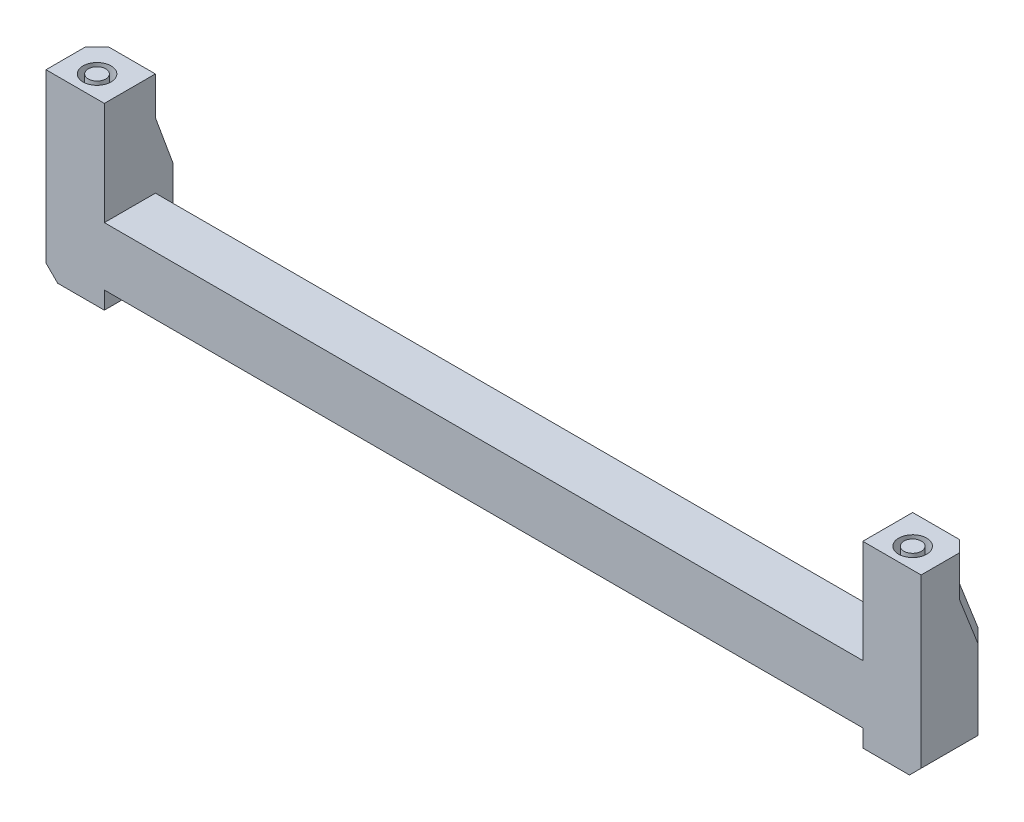
ISO-10303-21;
HEADER;
FILE_DESCRIPTION(('STEP AP214'),'2;1');
FILE_NAME('part.step','',(''),(''),'','','');
FILE_SCHEMA(('AUTOMOTIVE_DESIGN { 1 0 10303 214 1 1 1 1 }'));
ENDSEC;
DATA;
#1=APPLICATION_CONTEXT('core data for automotive mechanical design processes');
#2=APPLICATION_PROTOCOL_DEFINITION('international standard','automotive_design',2000,#1);
#3=PRODUCT_CONTEXT('',#1,'mechanical');
#4=PRODUCT('Part','Part','',(#3));
#5=PRODUCT_RELATED_PRODUCT_CATEGORY('part','',(#4));
#6=PRODUCT_DEFINITION_FORMATION('','',#4);
#7=PRODUCT_DEFINITION_CONTEXT('part definition',#1,'design');
#8=PRODUCT_DEFINITION('design','',#6,#7);
#9=PRODUCT_DEFINITION_SHAPE('','',#8);
#10=(LENGTH_UNIT() NAMED_UNIT(*) SI_UNIT(.MILLI.,.METRE.));
#11=(NAMED_UNIT(*) PLANE_ANGLE_UNIT() SI_UNIT($,.RADIAN.));
#12=(NAMED_UNIT(*) SI_UNIT($,.STERADIAN.) SOLID_ANGLE_UNIT());
#13=UNCERTAINTY_MEASURE_WITH_UNIT(LENGTH_MEASURE(1.E-05),#10,'distance_accuracy_value','');
#14=(GEOMETRIC_REPRESENTATION_CONTEXT(3) GLOBAL_UNCERTAINTY_ASSIGNED_CONTEXT((#13)) GLOBAL_UNIT_ASSIGNED_CONTEXT((#10,
#11,#12)) REPRESENTATION_CONTEXT('',''));
#15=CARTESIAN_POINT('',(0.,0.,0.));
#16=DIRECTION('',(0.,0.,1.));
#17=DIRECTION('',(1.,0.,0.));
#18=AXIS2_PLACEMENT_3D('',#15,#16,#17);
#19=CARTESIAN_POINT('',(0.,-66.,-23.149994967554));
#20=DIRECTION('',(0.,-1.,0.));
#21=DIRECTION('',(0.,0.,-1.));
#22=AXIS2_PLACEMENT_3D('',#19,#20,#21);
#23=PLANE('',#22);
#24=CARTESIAN_POINT('',(-69.9989956396422,-66.,-15.0000008092634));
#25=DIRECTION('',(0.,1.,0.));
#26=DIRECTION('',(0.,0.,1.));
#27=AXIS2_PLACEMENT_3D('',#24,#25,#26);
#28=CIRCLE('',#27,1.5);
#29=CARTESIAN_POINT('',(-69.9989956396422,-66.,-13.5000008092634));
#30=VERTEX_POINT('',#29);
#31=EDGE_CURVE('E20',#30,#30,#28,.F.);
#32=ORIENTED_EDGE('',*,*,#31,.F.);
#33=EDGE_LOOP('',(#32));
#34=FACE_BOUND('',#33,.T.);
#35=ADVANCED_FACE('F17',(#34),#23,.F.);
#36=CARTESIAN_POINT('',(0.,-66.,-23.149994967554));
#37=DIRECTION('',(0.,-1.,0.));
#38=DIRECTION('',(0.,0.,-1.));
#39=AXIS2_PLACEMENT_3D('',#36,#37,#38);
#40=PLANE('',#39);
#41=CARTESIAN_POINT('',(70.0010010799524,-66.,-14.7999967067693));
#42=DIRECTION('',(0.,1.,0.));
#43=DIRECTION('',(0.,0.,1.));
#44=AXIS2_PLACEMENT_3D('',#41,#42,#43);
#45=CIRCLE('',#44,1.5);
#46=CARTESIAN_POINT('',(70.0010010799524,-66.,-13.2999967067693));
#47=VERTEX_POINT('',#46);
#48=EDGE_CURVE('E235',#47,#47,#45,.F.);
#49=ORIENTED_EDGE('',*,*,#48,.F.);
#50=EDGE_LOOP('',(#49));
#51=FACE_BOUND('',#50,.T.);
#52=ADVANCED_FACE('F245',(#51),#40,.F.);
#53=CARTESIAN_POINT('',(-69.9989956396422,-96.6999990873044,-15.0000008092632));
#54=DIRECTION('',(0.,1.,0.));
#55=DIRECTION('',(0.,0.,1.));
#56=AXIS2_PLACEMENT_3D('',#53,#54,#55);
#57=CYLINDRICAL_SURFACE('',#56,1.5);
#58=CARTESIAN_POINT('',(-69.9989956396422,-69.5000000037508,-15.0000008092633));
#59=DIRECTION('',(0.,1.,0.));
#60=DIRECTION('',(0.,0.,1.));
#61=AXIS2_PLACEMENT_3D('',#58,#59,#60);
#62=CIRCLE('',#61,1.5);
#63=CARTESIAN_POINT('',(-69.9989956396422,-69.5000000037508,-13.5000008092633));
#64=VERTEX_POINT('',#63);
#65=EDGE_CURVE('E233',#64,#64,#62,.F.);
#66=ORIENTED_EDGE('',*,*,#65,.F.);
#67=EDGE_LOOP('',(#66));
#68=FACE_BOUND('',#67,.T.);
#69=ORIENTED_EDGE('',*,*,#31,.T.);
#70=EDGE_LOOP('',(#69));
#71=FACE_BOUND('',#70,.T.);
#72=ADVANCED_FACE('F242',(#68,#71),#57,.T.);
#73=CARTESIAN_POINT('',(70.0010010799524,-96.7000010766095,-14.7999967067691));
#74=DIRECTION('',(0.,1.,0.));
#75=DIRECTION('',(0.,0.,1.));
#76=AXIS2_PLACEMENT_3D('',#73,#74,#75);
#77=CYLINDRICAL_SURFACE('',#76,1.5);
#78=CARTESIAN_POINT('',(70.0010010799524,-69.5000000037257,-14.7999967067692));
#79=DIRECTION('',(0.,1.,0.));
#80=DIRECTION('',(0.,0.,1.));
#81=AXIS2_PLACEMENT_3D('',#78,#79,#80);
#82=CIRCLE('',#81,1.5);
#83=CARTESIAN_POINT('',(70.0010010799524,-69.5000000037257,-13.2999967067692));
#84=VERTEX_POINT('',#83);
#85=EDGE_CURVE('E213',#84,#84,#82,.F.);
#86=ORIENTED_EDGE('',*,*,#85,.F.);
#87=EDGE_LOOP('',(#86));
#88=FACE_BOUND('',#87,.T.);
#89=ORIENTED_EDGE('',*,*,#48,.T.);
#90=EDGE_LOOP('',(#89));
#91=FACE_BOUND('',#90,.T.);
#92=ADVANCED_FACE('F376',(#88,#91),#77,.T.);
#93=CARTESIAN_POINT('',(-64.9989954728614,-69.5000000037255,19.7999944223629));
#94=DIRECTION('',(0.,1.,0.));
#95=DIRECTION('',(0.,0.,1.));
#96=AXIS2_PLACEMENT_3D('',#93,#94,#95);
#97=PLANE('',#96);
#98=ORIENTED_EDGE('',*,*,#65,.T.);
#99=EDGE_LOOP('',(#98));
#100=FACE_BOUND('',#99,.T.);
#101=CARTESIAN_POINT('',(-69.9989956396422,-69.5000000037508,-15.0000008092634));
#102=DIRECTION('',(0.,-1.,0.));
#103=DIRECTION('',(0.,0.,-1.));
#104=AXIS2_PLACEMENT_3D('',#101,#102,#103);
#105=CIRCLE('',#104,2.4);
#106=CARTESIAN_POINT('',(-69.9989956396422,-69.5000000037508,-17.4000008092634));
#107=VERTEX_POINT('',#106);
#108=EDGE_CURVE('E193',#107,#107,#105,.F.);
#109=ORIENTED_EDGE('',*,*,#108,.T.);
#110=EDGE_LOOP('',(#109));
#111=FACE_BOUND('',#110,.T.);
#112=ADVANCED_FACE('F372',(#100,#111),#97,.T.);
#113=CARTESIAN_POINT('',(65.0010010559896,-69.5000000037257,-19.7999945127524));
#114=DIRECTION('',(0.,1.,0.));
#115=DIRECTION('',(0.,0.,1.));
#116=AXIS2_PLACEMENT_3D('',#113,#114,#115);
#117=PLANE('',#116);
#118=ORIENTED_EDGE('',*,*,#85,.T.);
#119=EDGE_LOOP('',(#118));
#120=FACE_BOUND('',#119,.T.);
#121=CARTESIAN_POINT('',(70.0010010799524,-69.5000000037509,-14.7999967067693));
#122=DIRECTION('',(0.,-1.,0.));
#123=DIRECTION('',(0.,0.,-1.));
#124=AXIS2_PLACEMENT_3D('',#121,#122,#123);
#125=CIRCLE('',#124,2.4);
#126=CARTESIAN_POINT('',(70.0010010799524,-69.5000000037509,-17.1999967067693));
#127=VERTEX_POINT('',#126);
#128=EDGE_CURVE('E224',#127,#127,#125,.F.);
#129=ORIENTED_EDGE('',*,*,#128,.T.);
#130=EDGE_LOOP('',(#129));
#131=FACE_BOUND('',#130,.T.);
#132=ADVANCED_FACE('F368',(#120,#131),#117,.T.);
#133=CARTESIAN_POINT('',(74.001001045446,-84.7000002719467,-21.9999988959935));
#134=DIRECTION('',(0.707106777797698,0.,-0.707106784575397));
#135=DIRECTION('',(-0.707106784575397,0.,-0.707106777797698));
#136=AXIS2_PLACEMENT_3D('',#133,#134,#135);
#137=PLANE('',#136);
#138=DIRECTION('',(0.577350271956594,-0.577350269189632,0.577350266422652));
#139=VECTOR('',#138,1.);
#140=CARTESIAN_POINT('',(73.0010010406534,-93.7000010766095,-22.9999988912009));
#141=LINE('',#140,#139);
#142=CARTESIAN_POINT('',(73.001001045446,-93.700001081402,-22.9999988864083));
#143=VERTEX_POINT('',#142);
#144=CARTESIAN_POINT('',(74.5010010478422,-95.2000010766095,-21.4999988983897));
#145=VERTEX_POINT('',#144);
#146=EDGE_CURVE('E447',#143,#145,#141,.T.);
#147=ORIENTED_EDGE('',*,*,#146,.F.);
#148=DIRECTION('',(0.,1.,0.));
#149=VECTOR('',#148,1.);
#150=CARTESIAN_POINT('',(73.0010010406534,-80.7000000037258,-22.999998891201));
#151=LINE('',#150,#149);
#152=CARTESIAN_POINT('',(73.0010010425704,-80.7000000037258,-22.999998891201));
#153=VERTEX_POINT('',#152);
#154=EDGE_CURVE('E456',#153,#143,#151,.F.);
#155=ORIENTED_EDGE('',*,*,#154,.F.);
#156=DIRECTION('',(-0.700926771305778,0.131921688709775,-0.700926764587299));
#157=VECTOR('',#156,1.);
#158=CARTESIAN_POINT('',(75.0010010502385,-81.076420750493,-20.9999989007861));
#159=LINE('',#158,#157);
#160=CARTESIAN_POINT('',(75.0010010502385,-81.0764207504929,-20.9999989007861));
#161=VERTEX_POINT('',#160);
#162=EDGE_CURVE('E209',#161,#153,#159,.T.);
#163=ORIENTED_EDGE('',*,*,#162,.F.);
#164=DIRECTION('',(0.,1.,0.));
#165=VECTOR('',#164,1.);
#166=CARTESIAN_POINT('',(75.0010010502385,-80.3500005401675,-20.999998900786));
#167=LINE('',#166,#165);
#168=CARTESIAN_POINT('',(75.0010010502385,-94.7000010766095,-20.999998900786));
#169=VERTEX_POINT('',#168);
#170=EDGE_CURVE('E227',#169,#161,#167,.T.);
#171=ORIENTED_EDGE('',*,*,#170,.F.);
#172=DIRECTION('',(-0.577350271956609,-0.577350269189626,-0.577350266422643));
#173=VECTOR('',#172,1.);
#174=CARTESIAN_POINT('',(75.0010010502385,-94.7000010766095,-20.999998900786));
#175=LINE('',#174,#173);
#176=EDGE_CURVE('E211',#169,#145,#175,.T.);
#177=ORIENTED_EDGE('',*,*,#176,.T.);
#178=EDGE_LOOP('',(#147,#155,#163,#171,#177));
#179=FACE_BOUND('',#178,.T.);
#180=ADVANCED_FACE('F364',(#179),#137,.T.);
#181=CARTESIAN_POINT('',(74.0010010488274,-79.0802158249389,-21.294439089428));
#182=DIRECTION('',(0.70710677802957,0.257063659426426,-0.658724737251406));
#183=DIRECTION('',(-0.681631317766084,0.,-0.731695801983633));
#184=AXIS2_PLACEMENT_3D('',#181,#182,#183);
#185=PLANE('',#184);
#186=DIRECTION('',(0.,0.931577452499033,0.36354291355411));
#187=VECTOR('',#186,1.);
#188=CARTESIAN_POINT('',(73.0010010559896,-72.499999990741,-19.7999945460257));
#189=LINE('',#188,#187);
#190=CARTESIAN_POINT('',(73.001001055991,-72.4999999972334,-19.7999945485593));
#191=VERTEX_POINT('',#190);
#192=EDGE_CURVE('E458',#191,#153,#189,.F.);
#193=ORIENTED_EDGE('',*,*,#192,.F.);
#194=DIRECTION('',(-0.700926771305773,0.131921688709743,-0.70092676458731));
#195=VECTOR('',#194,1.);
#196=CARTESIAN_POINT('',(75.0010010655747,-72.8764207504928,-17.799994560678));
#197=LINE('',#196,#195);
#198=CARTESIAN_POINT('',(75.0010010875147,-72.8764207546221,-17.799994538738));
#199=VERTEX_POINT('',#198);
#200=EDGE_CURVE('E442',#199,#191,#197,.T.);
#201=ORIENTED_EDGE('',*,*,#200,.F.);
#202=DIRECTION('',(1.74230028606085E-09,0.931577452499034,0.363542913554108));
#203=VECTOR('',#202,1.);
#204=CARTESIAN_POINT('',(75.0010010502385,-81.076420750493,-20.9999989007861));
#205=LINE('',#204,#203);
#206=EDGE_CURVE('E438',#161,#199,#205,.T.);
#207=ORIENTED_EDGE('',*,*,#206,.F.);
#208=ORIENTED_EDGE('',*,*,#162,.T.);
#209=EDGE_LOOP('',(#193,#201,#207,#208));
#210=FACE_BOUND('',#209,.T.);
#211=ADVANCED_FACE('F360',(#210),#185,.T.);
#212=CARTESIAN_POINT('',(-73.9989956689181,-78.4407562479254,-21.1086263529858));
#213=DIRECTION('',(-0.707106784369094,0.242948518321957,-0.664060247977822));
#214=DIRECTION('',(-0.684570540346749,0.,0.728946620329198));
#215=AXIS2_PLACEMENT_3D('',#212,#213,#214);
#216=PLANE('',#215);
#217=DIRECTION('',(-1.64663216250992E-09,-0.939123013715632,-0.343581089569362));
#218=VECTOR('',#217,1.);
#219=CARTESIAN_POINT('',(-74.99899565402,-72.8543675060854,-18.0000053389722));
#220=LINE('',#219,#218);
#221=CARTESIAN_POINT('',(-74.9989956540199,-72.8543675060933,-18.0000053389751));
#222=VERTEX_POINT('',#221);
#223=CARTESIAN_POINT('',(-74.9989956683975,-81.0543675060853,-21.0000009660859));
#224=VERTEX_POINT('',#223);
#225=EDGE_CURVE('E415',#222,#224,#220,.T.);
#226=ORIENTED_EDGE('',*,*,#225,.F.);
#227=DIRECTION('',(-0.701621528632481,-0.124315934947432,0.701621535357608));
#228=VECTOR('',#227,1.);
#229=CARTESIAN_POINT('',(-72.998995663605,-72.5000000037257,-20.0000053485573));
#230=LINE('',#229,#228);
#231=CARTESIAN_POINT('',(-72.9989956671994,-72.5000000037257,-20.0000053485573));
#232=VERTEX_POINT('',#231);
#233=EDGE_CURVE('E206',#232,#222,#230,.T.);
#234=ORIENTED_EDGE('',*,*,#233,.F.);
#235=DIRECTION('',(0.,0.939123013715632,0.343581089569361));
#236=VECTOR('',#235,1.);
#237=CARTESIAN_POINT('',(-72.9989956779826,-80.7000000160967,-23.0000009801971));
#238=LINE('',#237,#236);
#239=CARTESIAN_POINT('',(-72.9989956779826,-80.700000005272,-23.0000009762368));
#240=VERTEX_POINT('',#239);
#241=EDGE_CURVE('E200',#240,#232,#238,.T.);
#242=ORIENTED_EDGE('',*,*,#241,.F.);
#243=DIRECTION('',(0.701621528632486,0.124315934947432,-0.701621535357603));
#244=VECTOR('',#243,1.);
#245=CARTESIAN_POINT('',(-74.9989956683975,-81.0543675060853,-21.0000009660859));
#246=LINE('',#245,#244);
#247=EDGE_CURVE('E176',#224,#240,#246,.T.);
#248=ORIENTED_EDGE('',*,*,#247,.F.);
#249=EDGE_LOOP('',(#226,#234,#242,#248));
#250=FACE_BOUND('',#249,.T.);
#251=ADVANCED_FACE('F357',(#250),#216,.T.);
#252=CARTESIAN_POINT('',(-73.9989956731901,-92.6999993164097,-22.0000009708784));
#253=DIRECTION('',(-0.707106784575395,0.,-0.7071067777977));
#254=DIRECTION('',(-0.7071067777977,0.,0.707106784575395));
#255=AXIS2_PLACEMENT_3D('',#252,#253,#254);
#256=PLANE('',#255);
#257=DIRECTION('',(0.577350266422667,-0.57735026918965,-0.577350271956561));
#258=VECTOR('',#257,1.);
#259=CARTESIAN_POINT('',(-74.9989956683976,-94.6999990873045,-21.0000009660859));
#260=LINE('',#259,#258);
#261=CARTESIAN_POINT('',(-74.9989956625567,-94.6999990931453,-21.0000009719268));
#262=VERTEX_POINT('',#261);
#263=CARTESIAN_POINT('',(-74.4989956707938,-95.1999990873044,-21.5000009684821));
#264=VERTEX_POINT('',#263);
#265=EDGE_CURVE('E421',#262,#264,#260,.T.);
#266=ORIENTED_EDGE('',*,*,#265,.F.);
#267=DIRECTION('',(0.,1.,0.));
#268=VECTOR('',#267,1.);
#269=CARTESIAN_POINT('',(-74.9989956683977,-66.,-21.0000009660859));
#270=LINE('',#269,#268);
#271=EDGE_CURVE('E413',#224,#262,#270,.F.);
#272=ORIENTED_EDGE('',*,*,#271,.F.);
#273=ORIENTED_EDGE('',*,*,#247,.T.);
#274=DIRECTION('',(0.,1.,0.));
#275=VECTOR('',#274,1.);
#276=CARTESIAN_POINT('',(-72.9989956779826,-96.6999990873044,-23.000000975671));
#277=LINE('',#276,#275);
#278=CARTESIAN_POINT('',(-72.9989956779826,-93.6999990873044,-23.000000975671));
#279=VERTEX_POINT('',#278);
#280=EDGE_CURVE('E192',#279,#240,#277,.T.);
#281=ORIENTED_EDGE('',*,*,#280,.F.);
#282=DIRECTION('',(0.577350266422641,0.577350269189624,-0.577350271956612));
#283=VECTOR('',#282,1.);
#284=CARTESIAN_POINT('',(-74.4989956707938,-95.1999990873044,-21.5000009684821));
#285=LINE('',#284,#283);
#286=EDGE_CURVE('E183',#264,#279,#285,.T.);
#287=ORIENTED_EDGE('',*,*,#286,.F.);
#288=EDGE_LOOP('',(#266,#272,#273,#281,#287));
#289=FACE_BOUND('',#288,.T.);
#290=ADVANCED_FACE('F202',(#289),#256,.T.);
#291=CARTESIAN_POINT('',(-73.9989956588124,-80.6000002719466,-19.0000053437648));
#292=DIRECTION('',(-0.707106784575395,0.,-0.7071067777977));
#293=DIRECTION('',(-0.7071067777977,0.,0.707106784575395));
#294=AXIS2_PLACEMENT_3D('',#291,#292,#293);
#295=PLANE('',#294);
#296=ORIENTED_EDGE('',*,*,#233,.T.);
#297=DIRECTION('',(0.,1.,0.));
#298=VECTOR('',#297,1.);
#299=CARTESIAN_POINT('',(-74.99899565402,-66.,-18.0000053389838));
#300=LINE('',#299,#298);
#301=CARTESIAN_POINT('',(-74.9989956459326,-66.0000000001406,-18.0000053470688));
#302=VERTEX_POINT('',#301);
#303=EDGE_CURVE('E405',#302,#222,#300,.F.);
#304=ORIENTED_EDGE('',*,*,#303,.F.);
#305=DIRECTION('',(0.707106777799487,0.,-0.707106784573608));
#306=VECTOR('',#305,1.);
#307=CARTESIAN_POINT('',(-74.9989956540217,-66.,-18.0000053389838));
#308=LINE('',#307,#306);
#309=CARTESIAN_POINT('',(-72.9989956636055,-66.0000000004257,-20.0000053485577));
#310=VERTEX_POINT('',#309);
#311=EDGE_CURVE('E396',#302,#310,#308,.T.);
#312=ORIENTED_EDGE('',*,*,#311,.T.);
#313=DIRECTION('',(0.,1.,0.));
#314=VECTOR('',#313,1.);
#315=CARTESIAN_POINT('',(-72.998995663605,-72.5000000037257,-20.0000053485574));
#316=LINE('',#315,#314);
#317=EDGE_CURVE('E403',#232,#310,#316,.T.);
#318=ORIENTED_EDGE('',*,*,#317,.F.);
#319=EDGE_LOOP('',(#296,#304,#312,#318));
#320=FACE_BOUND('',#319,.T.);
#321=ADVANCED_FACE('F350',(#320),#295,.T.);
#322=CARTESIAN_POINT('',(-69.9989956396422,-68.5000000037256,-15.0000008092634));
#323=DIRECTION('',(0.,-1.,0.));
#324=DIRECTION('',(0.,0.,-1.));
#325=AXIS2_PLACEMENT_3D('',#322,#323,#324);
#326=CYLINDRICAL_SURFACE('',#325,2.4);
#327=ORIENTED_EDGE('',*,*,#108,.F.);
#328=EDGE_LOOP('',(#327));
#329=FACE_BOUND('',#328,.T.);
#330=CARTESIAN_POINT('',(-69.9989956396422,-66.,-15.0000008092634));
#331=DIRECTION('',(0.,-1.,0.));
#332=DIRECTION('',(0.,0.,-1.));
#333=AXIS2_PLACEMENT_3D('',#330,#331,#332);
#334=CIRCLE('',#333,2.4);
#335=CARTESIAN_POINT('',(-69.9989956396422,-66.,-17.4000008092634));
#336=VERTEX_POINT('',#335);
#337=EDGE_CURVE('E219',#336,#336,#334,.F.);
#338=ORIENTED_EDGE('',*,*,#337,.T.);
#339=EDGE_LOOP('',(#338));
#340=FACE_BOUND('',#339,.T.);
#341=ADVANCED_FACE('F347',(#329,#340),#326,.F.);
#342=CARTESIAN_POINT('',(-64.9989956707938,-95.1999990873044,-21.5000010140114));
#343=DIRECTION('',(-3.38884685552269E-09,-0.707106781186551,-0.707106781186544));
#344=DIRECTION('',(0.,0.707106781186544,-0.707106781186551));
#345=AXIS2_PLACEMENT_3D('',#342,#343,#344);
#346=PLANE('',#345);
#347=ORIENTED_EDGE('',*,*,#286,.T.);
#348=DIRECTION('',(-1.,0.,4.79255318387948E-09));
#349=VECTOR('',#348,1.);
#350=CARTESIAN_POINT('',(-64.9989956779826,-93.6999990873044,-23.0000010140114));
#351=LINE('',#350,#349);
#352=CARTESIAN_POINT('',(-64.9989956779826,-93.6999990968895,-23.0000010044263));
#353=VERTEX_POINT('',#352);
#354=EDGE_CURVE('E187',#353,#279,#351,.T.);
#355=ORIENTED_EDGE('',*,*,#354,.F.);
#356=DIRECTION('',(-3.38884831051159E-09,0.707106781186548,-0.707106781186547));
#357=VECTOR('',#356,1.);
#358=CARTESIAN_POINT('',(-64.9989956636049,-96.6999990873044,-20.0000010140114));
#359=LINE('',#358,#357);
#360=CARTESIAN_POINT('',(-64.9989956671994,-96.6999990873088,-20.0000009948368));
#361=VERTEX_POINT('',#360);
#362=EDGE_CURVE('E551',#361,#353,#359,.T.);
#363=ORIENTED_EDGE('',*,*,#362,.F.);
#364=DIRECTION('',(1.,0.,0.));
#365=VECTOR('',#364,1.);
#366=CARTESIAN_POINT('',(-64.9989956013018,-96.6999990873044,-20.000000975671));
#367=LINE('',#366,#365);
#368=CARTESIAN_POINT('',(-72.998995662996,-96.6999990777193,-20.0000009852561));
#369=VERTEX_POINT('',#368);
#370=EDGE_CURVE('E423',#369,#361,#367,.T.);
#371=ORIENTED_EDGE('',*,*,#370,.F.);
#372=DIRECTION('',(0.577350271956621,-0.577350269189627,0.577350266422629));
#373=VECTOR('',#372,1.);
#374=CARTESIAN_POINT('',(-74.4989956707938,-95.1999990873044,-21.5000009684821));
#375=LINE('',#374,#373);
#376=EDGE_CURVE('E190',#264,#369,#375,.T.);
#377=ORIENTED_EDGE('',*,*,#376,.F.);
#378=EDGE_LOOP('',(#347,#355,#363,#371,#377));
#379=FACE_BOUND('',#378,.T.);
#380=ADVANCED_FACE('F185',(#379),#346,.T.);
#381=CARTESIAN_POINT('',(-64.9989956779826,-96.6999990873044,-23.0000010140114));
#382=DIRECTION('',(-4.79255318387948E-09,0.,-1.));
#383=DIRECTION('',(-1.,0.,4.79255318387948E-09));
#384=AXIS2_PLACEMENT_3D('',#381,#382,#383);
#385=PLANE('',#384);
#386=DIRECTION('',(0.,1.,0.));
#387=VECTOR('',#386,1.);
#388=CARTESIAN_POINT('',(-64.9989956779826,-79.6000005401674,-23.0000010140114));
#389=LINE('',#388,#387);
#390=CARTESIAN_POINT('',(-64.9989956743882,-80.7000000037255,-23.0000010140115));
#391=VERTEX_POINT('',#390);
#392=EDGE_CURVE('E199',#353,#391,#389,.T.);
#393=ORIENTED_EDGE('',*,*,#392,.F.);
#394=ORIENTED_EDGE('',*,*,#354,.T.);
#395=ORIENTED_EDGE('',*,*,#280,.T.);
#396=DIRECTION('',(1.,1.54638873356066E-09,-4.22680203284067E-09));
#397=VECTOR('',#396,1.);
#398=CARTESIAN_POINT('',(-64.9989956779826,-80.7000000037256,-23.0000010140115));
#399=LINE('',#398,#397);
#400=EDGE_CURVE('E465',#391,#240,#399,.F.);
#401=ORIENTED_EDGE('',*,*,#400,.F.);
#402=EDGE_LOOP('',(#393,#394,#395,#401));
#403=FACE_BOUND('',#402,.T.);
#404=ADVANCED_FACE('F196',(#403),#385,.T.);
#405=CARTESIAN_POINT('',(-64.9989956779826,-80.7000000037256,-23.0000010140115));
#406=DIRECTION('',(-4.50079698943524E-09,0.343581089569361,-0.939123013715632));
#407=DIRECTION('',(0.,0.939123013715632,0.343581089569361));
#408=AXIS2_PLACEMENT_3D('',#405,#406,#407);
#409=PLANE('',#408);
#410=DIRECTION('',(1.64663057312578E-09,0.939123013715632,0.343581089569362));
#411=VECTOR('',#410,1.);
#412=CARTESIAN_POINT('',(-64.9989956779826,-80.7000000037256,-23.0000010140115));
#413=LINE('',#412,#411);
#414=CARTESIAN_POINT('',(-64.9989956636078,-72.4999999975401,-20.0000053846348));
#415=VERTEX_POINT('',#414);
#416=EDGE_CURVE('E548',#391,#415,#413,.T.);
#417=ORIENTED_EDGE('',*,*,#416,.F.);
#418=ORIENTED_EDGE('',*,*,#400,.T.);
#419=ORIENTED_EDGE('',*,*,#241,.T.);
#420=DIRECTION('',(-1.,0.,4.79255318387948E-09));
#421=VECTOR('',#420,1.);
#422=CARTESIAN_POINT('',(-64.998995663605,-72.5000000037257,-20.0000053868978));
#423=LINE('',#422,#421);
#424=EDGE_CURVE('E462',#415,#232,#423,.T.);
#425=ORIENTED_EDGE('',*,*,#424,.F.);
#426=EDGE_LOOP('',(#417,#418,#419,#425));
#427=FACE_BOUND('',#426,.T.);
#428=ADVANCED_FACE('F338',(#427),#409,.T.);
#429=CARTESIAN_POINT('',(-64.998995663605,-72.5000000037257,-20.0000053868978));
#430=DIRECTION('',(-4.79255318387948E-09,0.,-1.));
#431=DIRECTION('',(-1.,0.,4.79255318387948E-09));
#432=AXIS2_PLACEMENT_3D('',#429,#430,#431);
#433=PLANE('',#432);
#434=ORIENTED_EDGE('',*,*,#424,.T.);
#435=ORIENTED_EDGE('',*,*,#317,.T.);
#436=DIRECTION('',(1.,0.,0.));
#437=VECTOR('',#436,1.);
#438=CARTESIAN_POINT('',(0.,-66.,-20.0000053485588));
#439=LINE('',#438,#437);
#440=CARTESIAN_POINT('',(-64.9989956636134,-66.0000000004298,-20.0000053773131));
#441=VERTEX_POINT('',#440);
#442=EDGE_CURVE('E223',#310,#441,#439,.T.);
#443=ORIENTED_EDGE('',*,*,#442,.T.);
#444=DIRECTION('',(0.,1.,0.));
#445=VECTOR('',#444,1.);
#446=CARTESIAN_POINT('',(-64.998995663605,-79.6000005401674,-20.0000053868978));
#447=LINE('',#446,#445);
#448=EDGE_CURVE('E470',#415,#441,#447,.T.);
#449=ORIENTED_EDGE('',*,*,#448,.F.);
#450=EDGE_LOOP('',(#434,#435,#443,#449));
#451=FACE_BOUND('',#450,.T.);
#452=ADVANCED_FACE('F334',(#451),#433,.T.);
#453=CARTESIAN_POINT('',(65.0010010559896,-72.5000000037257,-19.7999945127524));
#454=DIRECTION('',(-4.46463881615503E-09,0.36354291355411,-0.931577452499033));
#455=DIRECTION('',(0.,0.931577452499033,0.36354291355411));
#456=AXIS2_PLACEMENT_3D('',#453,#454,#455);
#457=PLANE('',#456);
#458=DIRECTION('',(-1.74230028606086E-09,-0.931577452499033,-0.363542913554112));
#459=VECTOR('',#458,1.);
#460=CARTESIAN_POINT('',(65.0010010559896,-72.5000000037257,-19.7999945127524));
#461=LINE('',#460,#459);
#462=CARTESIAN_POINT('',(65.0010010521555,-72.5000000037372,-19.7999945127569));
#463=VERTEX_POINT('',#462);
#464=CARTESIAN_POINT('',(65.0010010406534,-80.7000000102181,-22.9999988553941));
#465=VERTEX_POINT('',#464);
#466=EDGE_CURVE('E533',#463,#465,#461,.T.);
#467=ORIENTED_EDGE('',*,*,#466,.F.);
#468=DIRECTION('',(-1.,0.,4.79255783207104E-09));
#469=VECTOR('',#468,1.);
#470=CARTESIAN_POINT('',(75.0010010559896,-72.5000000037257,-19.799994560678));
#471=LINE('',#470,#469);
#472=EDGE_CURVE('E445',#191,#463,#471,.T.);
#473=ORIENTED_EDGE('',*,*,#472,.F.);
#474=ORIENTED_EDGE('',*,*,#192,.T.);
#475=DIRECTION('',(-1.,0.,4.79255783207104E-09));
#476=VECTOR('',#475,1.);
#477=CARTESIAN_POINT('',(65.0010010406534,-80.7000000037258,-22.9999988528605));
#478=LINE('',#477,#476);
#479=EDGE_CURVE('E453',#465,#153,#478,.F.);
#480=ORIENTED_EDGE('',*,*,#479,.F.);
#481=EDGE_LOOP('',(#467,#473,#474,#480));
#482=FACE_BOUND('',#481,.T.);
#483=ADVANCED_FACE('F330',(#482),#457,.T.);
#484=CARTESIAN_POINT('',(65.0010010406534,-80.7000000037258,-22.9999988528605));
#485=DIRECTION('',(-4.79255783207104E-09,0.,-1.));
#486=DIRECTION('',(-1.,0.,4.79255783207104E-09));
#487=AXIS2_PLACEMENT_3D('',#484,#485,#486);
#488=PLANE('',#487);
#489=DIRECTION('',(0.,1.,0.));
#490=VECTOR('',#489,1.);
#491=CARTESIAN_POINT('',(65.0010010406534,-79.6000005401675,-22.9999988528605));
#492=LINE('',#491,#490);
#493=CARTESIAN_POINT('',(65.0010010442478,-93.7000010766095,-22.9999988528604));
#494=VERTEX_POINT('',#493);
#495=EDGE_CURVE('E531',#465,#494,#492,.F.);
#496=ORIENTED_EDGE('',*,*,#495,.F.);
#497=ORIENTED_EDGE('',*,*,#479,.T.);
#498=ORIENTED_EDGE('',*,*,#154,.T.);
#499=DIRECTION('',(1.,-2.39627891603553E-09,-2.39627891603551E-09));
#500=VECTOR('',#499,1.);
#501=CARTESIAN_POINT('',(65.0010010478422,-93.7000010766095,-22.9999988528604));
#502=LINE('',#501,#500);
#503=EDGE_CURVE('E450',#494,#143,#502,.T.);
#504=ORIENTED_EDGE('',*,*,#503,.F.);
#505=EDGE_LOOP('',(#496,#497,#498,#504));
#506=FACE_BOUND('',#505,.T.);
#507=ADVANCED_FACE('F326',(#506),#488,.T.);
#508=CARTESIAN_POINT('',(65.0010010478422,-95.2000010766095,-21.4999988528604));
#509=DIRECTION('',(-3.38885014228613E-09,-0.707106781186551,-0.707106781186544));
#510=DIRECTION('',(0.,0.707106781186544,-0.707106781186551));
#511=AXIS2_PLACEMENT_3D('',#508,#509,#510);
#512=PLANE('',#511);
#513=DIRECTION('',(0.577350266422644,0.577350269189627,-0.577350271956607));
#514=VECTOR('',#513,1.);
#515=CARTESIAN_POINT('',(73.0010010550311,-96.7000010766095,-19.9999988912009));
#516=LINE('',#515,#514);
#517=CARTESIAN_POINT('',(73.0010010604099,-96.7000010712306,-19.9999988869946));
#518=VERTEX_POINT('',#517);
#519=EDGE_CURVE('E433',#518,#145,#516,.T.);
#520=ORIENTED_EDGE('',*,*,#519,.F.);
#521=DIRECTION('',(1.,0.,0.));
#522=VECTOR('',#521,1.);
#523=CARTESIAN_POINT('',(65.0010010406534,-96.7000010766095,-19.9999988528604));
#524=LINE('',#523,#522);
#525=CARTESIAN_POINT('',(65.0010010655148,-96.7000010670244,-19.9999988624455));
#526=VERTEX_POINT('',#525);
#527=EDGE_CURVE('E429',#526,#518,#524,.T.);
#528=ORIENTED_EDGE('',*,*,#527,.F.);
#529=DIRECTION('',(3.38885158153755E-09,-0.707106781186548,0.707106781186547));
#530=VECTOR('',#529,1.);
#531=CARTESIAN_POINT('',(65.0010010406534,-93.7000010766095,-22.9999988528604));
#532=LINE('',#531,#530);
#533=EDGE_CURVE('E529',#494,#526,#532,.T.);
#534=ORIENTED_EDGE('',*,*,#533,.F.);
#535=ORIENTED_EDGE('',*,*,#503,.T.);
#536=ORIENTED_EDGE('',*,*,#146,.T.);
#537=EDGE_LOOP('',(#520,#528,#534,#535,#536));
#538=FACE_BOUND('',#537,.T.);
#539=ADVANCED_FACE('F322',(#538),#512,.T.);
#540=CARTESIAN_POINT('',(74.9989953281253,-83.7000005401676,-19.9999996196601));
#541=DIRECTION('',(-4.79255768693432E-09,0.,-1.));
#542=DIRECTION('',(-1.,0.,4.79255768693432E-09));
#543=AXIS2_PLACEMENT_3D('',#540,#541,#542);
#544=PLANE('',#543);
#545=DIRECTION('',(0.,1.,0.));
#546=VECTOR('',#545,1.);
#547=CARTESIAN_POINT('',(65.0010010550311,-79.6000005401675,-19.9999995717441));
#548=LINE('',#547,#546);
#549=CARTESIAN_POINT('',(65.0010010550311,-93.7000005401679,-19.9999992602279));
#550=VERTEX_POINT('',#549);
#551=CARTESIAN_POINT('',(65.0010010656634,-83.7000005401676,-19.9999995717441));
#552=VERTEX_POINT('',#551);
#553=EDGE_CURVE('E522',#550,#552,#548,.T.);
#554=ORIENTED_EDGE('',*,*,#553,.F.);
#555=DIRECTION('',(1.,0.,0.));
#556=VECTOR('',#555,1.);
#557=CARTESIAN_POINT('',(74.9989953281253,-93.7000005401676,-19.9999989487116));
#558=LINE('',#557,#556);
#559=CARTESIAN_POINT('',(-64.9989956531212,-93.7000005401676,-19.9999989487116));
#560=VERTEX_POINT('',#559);
#561=EDGE_CURVE('E425',#560,#550,#558,.T.);
#562=ORIENTED_EDGE('',*,*,#561,.F.);
#563=DIRECTION('',(0.,1.,0.));
#564=VECTOR('',#563,1.);
#565=CARTESIAN_POINT('',(-64.9989956636049,-79.6000005401674,-19.9999989487116));
#566=LINE('',#565,#564);
#567=CARTESIAN_POINT('',(-64.9989956636049,-83.7000005401676,-19.9999991044698));
#568=VERTEX_POINT('',#567);
#569=EDGE_CURVE('E544',#568,#560,#566,.F.);
#570=ORIENTED_EDGE('',*,*,#569,.F.);
#571=DIRECTION('',(1.,0.,0.));
#572=VECTOR('',#571,1.);
#573=CARTESIAN_POINT('',(74.9989953760509,-83.7000005401676,-19.9999995717441));
#574=LINE('',#573,#572);
#575=EDGE_CURVE('E540',#552,#568,#574,.F.);
#576=ORIENTED_EDGE('',*,*,#575,.F.);
#577=EDGE_LOOP('',(#554,#562,#570,#576));
#578=FACE_BOUND('',#577,.T.);
#579=ADVANCED_FACE('F318',(#578),#544,.T.);
#580=CARTESIAN_POINT('',(75.0010010559896,-72.5000000037257,-19.799994560678));
#581=DIRECTION('',(-4.79255783207104E-09,0.,-1.));
#582=DIRECTION('',(-1.,0.,4.79255783207104E-09));
#583=AXIS2_PLACEMENT_3D('',#580,#581,#582);
#584=PLANE('',#583);
#585=ORIENTED_EDGE('',*,*,#472,.T.);
#586=DIRECTION('',(0.,1.,0.));
#587=VECTOR('',#586,1.);
#588=CARTESIAN_POINT('',(65.0010010559896,-79.6000005401675,-19.7999945127704));
#589=LINE('',#588,#587);
#590=CARTESIAN_POINT('',(65.0010010662336,-66.0000000004115,-19.7999945127659));
#591=VERTEX_POINT('',#590);
#592=EDGE_CURVE('E535',#591,#463,#589,.F.);
#593=ORIENTED_EDGE('',*,*,#592,.F.);
#594=DIRECTION('',(1.,0.,0.));
#595=VECTOR('',#594,1.);
#596=CARTESIAN_POINT('',(0.,-66.,-19.7999945127704));
#597=LINE('',#596,#595);
#598=CARTESIAN_POINT('',(73.0010010655855,-66.0000000004097,-19.7999945415123));
#599=VERTEX_POINT('',#598);
#600=EDGE_CURVE('E513',#591,#599,#597,.T.);
#601=ORIENTED_EDGE('',*,*,#600,.T.);
#602=DIRECTION('',(0.,1.,0.));
#603=VECTOR('',#602,1.);
#604=CARTESIAN_POINT('',(73.0010010559896,-80.6000002719467,-19.7999945510929));
#605=LINE('',#604,#603);
#606=EDGE_CURVE('E228',#191,#599,#605,.T.);
#607=ORIENTED_EDGE('',*,*,#606,.F.);
#608=EDGE_LOOP('',(#585,#593,#601,#607));
#609=FACE_BOUND('',#608,.T.);
#610=ADVANCED_FACE('F314',(#609),#584,.T.);
#611=CARTESIAN_POINT('',(74.0010010607822,-80.6000002719467,-18.7999945558854));
#612=DIRECTION('',(0.707106777797697,0.,-0.707106784575398));
#613=DIRECTION('',(-0.707106784575398,0.,-0.707106777797697));
#614=AXIS2_PLACEMENT_3D('',#611,#612,#613);
#615=PLANE('',#614);
#616=ORIENTED_EDGE('',*,*,#200,.T.);
#617=ORIENTED_EDGE('',*,*,#606,.T.);
#618=DIRECTION('',(0.707106800755658,0.,0.707106761617436));
#619=VECTOR('',#618,1.);
#620=CARTESIAN_POINT('',(73.0010010560011,-66.,-19.7999945511196));
#621=LINE('',#620,#619);
#622=CARTESIAN_POINT('',(75.0010011209006,-66.0000000001501,-17.799994528244));
#623=VERTEX_POINT('',#622);
#624=EDGE_CURVE('E218',#599,#623,#621,.T.);
#625=ORIENTED_EDGE('',*,*,#624,.T.);
#626=DIRECTION('',(0.,1.,0.));
#627=VECTOR('',#626,1.);
#628=CARTESIAN_POINT('',(75.0010010655747,-80.3500005401675,-17.799994560678));
#629=LINE('',#628,#627);
#630=EDGE_CURVE('E436',#199,#623,#629,.T.);
#631=ORIENTED_EDGE('',*,*,#630,.F.);
#632=EDGE_LOOP('',(#616,#617,#625,#631));
#633=FACE_BOUND('',#632,.T.);
#634=ADVANCED_FACE('F310',(#633),#615,.T.);
#635=CARTESIAN_POINT('',(70.0010010799524,-68.5000000037257,-14.7999967067693));
#636=DIRECTION('',(0.,-1.,0.));
#637=DIRECTION('',(0.,0.,-1.));
#638=AXIS2_PLACEMENT_3D('',#635,#636,#637);
#639=CYLINDRICAL_SURFACE('',#638,2.4);
#640=ORIENTED_EDGE('',*,*,#128,.F.);
#641=EDGE_LOOP('',(#640));
#642=FACE_BOUND('',#641,.T.);
#643=CARTESIAN_POINT('',(70.0010010799524,-66.,-14.7999967067693));
#644=DIRECTION('',(0.,-1.,0.));
#645=DIRECTION('',(0.,0.,-1.));
#646=AXIS2_PLACEMENT_3D('',#643,#644,#645);
#647=CIRCLE('',#646,2.4);
#648=CARTESIAN_POINT('',(70.0010010799524,-66.,-17.1999967067693));
#649=VERTEX_POINT('',#648);
#650=EDGE_CURVE('E214',#649,#649,#647,.F.);
#651=ORIENTED_EDGE('',*,*,#650,.T.);
#652=EDGE_LOOP('',(#651));
#653=FACE_BOUND('',#652,.T.);
#654=ADVANCED_FACE('F306',(#642,#653),#639,.F.);
#655=CARTESIAN_POINT('',(75.0010011508822,-80.3500005401675,9.87455239249431E-07));
#656=DIRECTION('',(1.,0.,-4.7925576840413E-09));
#657=DIRECTION('',(-4.7925576840413E-09,0.,-1.));
#658=AXIS2_PLACEMENT_3D('',#655,#656,#657);
#659=PLANE('',#658);
#660=ORIENTED_EDGE('',*,*,#630,.T.);
#661=DIRECTION('',(0.,0.,-1.));
#662=VECTOR('',#661,1.);
#663=CARTESIAN_POINT('',(75.0010011991184,-66.,-23.149994967554));
#664=LINE('',#663,#662);
#665=CARTESIAN_POINT('',(75.0010011539123,-66.0000000001498,-11.2499999999998));
#666=VERTEX_POINT('',#665);
#667=EDGE_CURVE('E517',#623,#666,#664,.F.);
#668=ORIENTED_EDGE('',*,*,#667,.T.);
#669=DIRECTION('',(0.,1.,0.));
#670=VECTOR('',#669,1.);
#671=CARTESIAN_POINT('',(75.0010012225987,-30.5433363392091,-11.2499999999997));
#672=LINE('',#671,#670);
#673=CARTESIAN_POINT('',(75.0010011225332,-94.7000010510422,-11.2499999999998));
#674=VERTEX_POINT('',#673);
#675=EDGE_CURVE('E217',#666,#674,#672,.F.);
#676=ORIENTED_EDGE('',*,*,#675,.T.);
#677=DIRECTION('',(2.3962761566687E-09,-2.3962761566687E-09,1.));
#678=VECTOR('',#677,1.);
#679=CARTESIAN_POINT('',(75.0010010550311,-94.700001081402,-18.9999988959934));
#680=LINE('',#679,#678);
#681=EDGE_CURVE('E431',#169,#674,#680,.T.);
#682=ORIENTED_EDGE('',*,*,#681,.F.);
#683=ORIENTED_EDGE('',*,*,#170,.T.);
#684=ORIENTED_EDGE('',*,*,#206,.T.);
#685=EDGE_LOOP('',(#660,#668,#676,#682,#683,#684));
#686=FACE_BOUND('',#685,.T.);
#687=ADVANCED_FACE('F302',(#686),#659,.T.);
#688=CARTESIAN_POINT('',(74.0010010598236,-95.7000010766095,-18.9999988959934));
#689=DIRECTION('',(0.707106781186548,-0.707106781186548,-3.38884623995215E-09));
#690=DIRECTION('',(0.707106781186548,0.707106781186548,0.));
#691=AXIS2_PLACEMENT_3D('',#688,#689,#690);
#692=PLANE('',#691);
#693=ORIENTED_EDGE('',*,*,#176,.F.);
#694=ORIENTED_EDGE('',*,*,#681,.T.);
#695=DIRECTION('',(-0.707106781105317,-0.707106781267778,0.));
#696=VECTOR('',#695,1.);
#697=CARTESIAN_POINT('',(75.001001096966,-94.7000010766094,-11.2499999999998));
#698=LINE('',#697,#696);
#699=CARTESIAN_POINT('',(73.0010010869506,-96.700001076256,-11.2499999999998));
#700=VERTEX_POINT('',#699);
#701=EDGE_CURVE('E506',#674,#700,#698,.T.);
#702=ORIENTED_EDGE('',*,*,#701,.T.);
#703=DIRECTION('',(0.,0.,-1.));
#704=VECTOR('',#703,1.);
#705=CARTESIAN_POINT('',(73.0010010550311,-96.7000010766095,-22.9999988528604));
#706=LINE('',#705,#704);
#707=EDGE_CURVE('E427',#518,#700,#706,.F.);
#708=ORIENTED_EDGE('',*,*,#707,.F.);
#709=ORIENTED_EDGE('',*,*,#519,.T.);
#710=EDGE_LOOP('',(#693,#694,#702,#708,#709));
#711=FACE_BOUND('',#710,.T.);
#712=ADVANCED_FACE('F298',(#711),#692,.T.);
#713=CARTESIAN_POINT('',(65.0010010406534,-96.7000010766095,-22.9999988528604));
#714=DIRECTION('',(0.,-1.,0.));
#715=DIRECTION('',(0.,0.,-1.));
#716=AXIS2_PLACEMENT_3D('',#713,#714,#715);
#717=PLANE('',#716);
#718=ORIENTED_EDGE('',*,*,#527,.T.);
#719=ORIENTED_EDGE('',*,*,#707,.T.);
#720=DIRECTION('',(-1.,0.,0.));
#721=VECTOR('',#720,1.);
#722=CARTESIAN_POINT('',(2.0122792321331E-13,-96.7000010762913,-11.2500000000002));
#723=LINE('',#722,#721);
#724=CARTESIAN_POINT('',(65.0010010969659,-96.7000010765299,-11.2499999999998));
#725=VERTEX_POINT('',#724);
#726=EDGE_CURVE('E503',#700,#725,#723,.T.);
#727=ORIENTED_EDGE('',*,*,#726,.T.);
#728=DIRECTION('',(4.79255746199669E-09,0.,1.));
#729=VECTOR('',#728,1.);
#730=CARTESIAN_POINT('',(65.0010011508822,-96.7000010766095,1.03538077050464E-06));
#731=LINE('',#730,#729);
#732=EDGE_CURVE('E527',#526,#725,#731,.T.);
#733=ORIENTED_EDGE('',*,*,#732,.F.);
#734=EDGE_LOOP('',(#718,#719,#727,#733));
#735=FACE_BOUND('',#734,.T.);
#736=ADVANCED_FACE('F294',(#735),#717,.T.);
#737=CARTESIAN_POINT('',(74.9989953281253,-93.7000005401676,-19.9999996196601));
#738=DIRECTION('',(0.,-1.,0.));
#739=DIRECTION('',(0.,0.,-1.));
#740=AXIS2_PLACEMENT_3D('',#737,#738,#739);
#741=PLANE('',#740);
#742=ORIENTED_EDGE('',*,*,#561,.T.);
#743=DIRECTION('',(4.79255746199669E-09,0.,1.));
#744=VECTOR('',#743,1.);
#745=CARTESIAN_POINT('',(65.0010011508822,-93.7000005401689,1.03538077050464E-06));
#746=LINE('',#745,#744);
#747=CARTESIAN_POINT('',(65.0010010864822,-93.7000005401686,-11.2499999999999));
#748=VERTEX_POINT('',#747);
#749=EDGE_CURVE('E524',#748,#550,#746,.F.);
#750=ORIENTED_EDGE('',*,*,#749,.F.);
#751=DIRECTION('',(-1.,0.,0.));
#752=VECTOR('',#751,1.);
#753=CARTESIAN_POINT('',(2.01227923213309E-13,-93.7000005401689,-11.2500000000002));
#754=LINE('',#753,#752);
#755=CARTESIAN_POINT('',(-64.9989956216701,-93.7000005401679,-11.2500000000002));
#756=VERTEX_POINT('',#755);
#757=EDGE_CURVE('E497',#748,#756,#754,.T.);
#758=ORIENTED_EDGE('',*,*,#757,.T.);
#759=DIRECTION('',(-4.79255281380514E-09,0.,-1.));
#760=VECTOR('',#759,1.);
#761=CARTESIAN_POINT('',(-64.9989955677539,-93.7000005401676,-1.12577019085319E-06));
#762=LINE('',#761,#760);
#763=EDGE_CURVE('E542',#560,#756,#762,.F.);
#764=ORIENTED_EDGE('',*,*,#763,.F.);
#765=EDGE_LOOP('',(#742,#750,#758,#764));
#766=FACE_BOUND('',#765,.T.);
#767=ADVANCED_FACE('F290',(#766),#741,.T.);
#768=CARTESIAN_POINT('',(-64.9989956013018,-96.6999990873043,-6.99999688341176));
#769=DIRECTION('',(0.,-1.,0.));
#770=DIRECTION('',(0.,0.,-1.));
#771=AXIS2_PLACEMENT_3D('',#768,#769,#770);
#772=PLANE('',#771);
#773=ORIENTED_EDGE('',*,*,#370,.T.);
#774=DIRECTION('',(-4.79255281380514E-09,0.,-1.));
#775=VECTOR('',#774,1.);
#776=CARTESIAN_POINT('',(-64.9989955677539,-96.6999990873221,-1.12577019085319E-06));
#777=LINE('',#776,#775);
#778=CARTESIAN_POINT('',(-64.9989956321538,-96.6999990873177,-11.2500000000006));
#779=VERTEX_POINT('',#778);
#780=EDGE_CURVE('E222',#779,#361,#777,.T.);
#781=ORIENTED_EDGE('',*,*,#780,.F.);
#782=DIRECTION('',(-1.,0.,0.));
#783=VECTOR('',#782,1.);
#784=CARTESIAN_POINT('',(2.0122792321331E-13,-96.6999990873221,-11.2500000000002));
#785=LINE('',#784,#783);
#786=CARTESIAN_POINT('',(-72.9989956276578,-96.6999990820669,-11.2500000000006));
#787=VERTEX_POINT('',#786);
#788=EDGE_CURVE('E491',#779,#787,#785,.T.);
#789=ORIENTED_EDGE('',*,*,#788,.T.);
#790=DIRECTION('',(2.39627909231861E-09,2.39627909231861E-09,1.));
#791=VECTOR('',#790,1.);
#792=CARTESIAN_POINT('',(-72.9989956420385,-96.6999990657379,-10.9999978729287));
#793=LINE('',#792,#791);
#794=EDGE_CURVE('E418',#369,#787,#793,.T.);
#795=ORIENTED_EDGE('',*,*,#794,.F.);
#796=EDGE_LOOP('',(#773,#781,#789,#795));
#797=FACE_BOUND('',#796,.T.);
#798=ADVANCED_FACE('F286',(#797),#772,.T.);
#799=CARTESIAN_POINT('',(-73.998995620472,-95.6999990873044,-10.9999978729287));
#800=DIRECTION('',(-0.707106781186548,-0.707106781186548,3.38885039158807E-09));
#801=DIRECTION('',(0.707106781186548,-0.707106781186548,0.));
#802=AXIS2_PLACEMENT_3D('',#799,#800,#801);
#803=PLANE('',#802);
#804=ORIENTED_EDGE('',*,*,#376,.T.);
#805=ORIENTED_EDGE('',*,*,#794,.T.);
#806=DIRECTION('',(-0.707106781065633,0.707106781307462,0.));
#807=VECTOR('',#806,1.);
#808=CARTESIAN_POINT('',(-72.9989956228287,-96.6999990868298,-11.2500000000006));
#809=LINE('',#808,#807);
#810=CARTESIAN_POINT('',(-74.9989956216702,-94.6999990873043,-11.2500000000006));
#811=VERTEX_POINT('',#810);
#812=EDGE_CURVE('E486',#787,#811,#809,.T.);
#813=ORIENTED_EDGE('',*,*,#812,.T.);
#814=DIRECTION('',(4.79255766349309E-09,0.,1.));
#815=VECTOR('',#814,1.);
#816=CARTESIAN_POINT('',(-74.9989956626466,-94.6999990873044,-19.7999952316265));
#817=LINE('',#816,#815);
#818=EDGE_CURVE('E408',#262,#811,#817,.T.);
#819=ORIENTED_EDGE('',*,*,#818,.F.);
#820=ORIENTED_EDGE('',*,*,#265,.T.);
#821=EDGE_LOOP('',(#804,#805,#813,#819,#820));
#822=FACE_BOUND('',#821,.T.);
#823=ADVANCED_FACE('F282',(#822),#803,.T.);
#824=CARTESIAN_POINT('',(-74.9989956626466,-66.,-19.7999952316265));
#825=DIRECTION('',(-1.,0.,4.79255766349309E-09));
#826=DIRECTION('',(4.79255766349309E-09,0.,1.));
#827=AXIS2_PLACEMENT_3D('',#824,#825,#826);
#828=PLANE('',#827);
#829=ORIENTED_EDGE('',*,*,#818,.T.);
#830=DIRECTION('',(0.,1.,0.));
#831=VECTOR('',#830,1.);
#832=CARTESIAN_POINT('',(-74.9989956216702,-30.5433363392091,-11.2500000000005));
#833=LINE('',#832,#831);
#834=CARTESIAN_POINT('',(-74.9989956216703,-66.,-11.2500000000006));
#835=VERTEX_POINT('',#834);
#836=EDGE_CURVE('E474',#811,#835,#833,.T.);
#837=ORIENTED_EDGE('',*,*,#836,.T.);
#838=DIRECTION('',(0.,0.,-1.));
#839=VECTOR('',#838,1.);
#840=CARTESIAN_POINT('',(-74.9989956216703,-66.,-23.149994967554));
#841=LINE('',#840,#839);
#842=EDGE_CURVE('E406',#835,#302,#841,.T.);
#843=ORIENTED_EDGE('',*,*,#842,.T.);
#844=ORIENTED_EDGE('',*,*,#303,.T.);
#845=ORIENTED_EDGE('',*,*,#225,.T.);
#846=ORIENTED_EDGE('',*,*,#271,.T.);
#847=EDGE_LOOP('',(#829,#837,#843,#844,#845,#846));
#848=FACE_BOUND('',#847,.T.);
#849=ADVANCED_FACE('F278',(#848),#828,.T.);
#850=CARTESIAN_POINT('',(0.,-66.,-23.149994967554));
#851=DIRECTION('',(0.,-1.,0.));
#852=DIRECTION('',(0.,0.,-1.));
#853=AXIS2_PLACEMENT_3D('',#850,#851,#852);
#854=PLANE('',#853);
#855=ORIENTED_EDGE('',*,*,#337,.F.);
#856=EDGE_LOOP('',(#855));
#857=FACE_BOUND('',#856,.T.);
#858=ORIENTED_EDGE('',*,*,#442,.F.);
#859=ORIENTED_EDGE('',*,*,#311,.F.);
#860=ORIENTED_EDGE('',*,*,#842,.F.);
#861=DIRECTION('',(-1.,0.,0.));
#862=VECTOR('',#861,1.);
#863=CARTESIAN_POINT('',(2.01227923213309E-13,-66.,-11.2500000000001));
#864=LINE('',#863,#862);
#865=CARTESIAN_POINT('',(-64.9989956427624,-66.0000000001408,-11.2500000000006));
#866=VERTEX_POINT('',#865);
#867=EDGE_CURVE('E476',#835,#866,#864,.F.);
#868=ORIENTED_EDGE('',*,*,#867,.T.);
#869=DIRECTION('',(-4.79255281380514E-09,0.,-1.));
#870=VECTOR('',#869,1.);
#871=CARTESIAN_POINT('',(-64.9989955677539,-66.0000000005629,-1.12577019085319E-06));
#872=LINE('',#871,#870);
#873=EDGE_CURVE('E399',#441,#866,#872,.F.);
#874=ORIENTED_EDGE('',*,*,#873,.F.);
#875=EDGE_LOOP('',(#858,#859,#860,#868,#874));
#876=FACE_BOUND('',#875,.T.);
#877=ADVANCED_FACE('F274',(#857,#876),#854,.F.);
#878=CARTESIAN_POINT('',(-64.9989955677539,-79.6000005401674,-1.12577019085319E-06));
#879=DIRECTION('',(1.,0.,-4.79255281380514E-09));
#880=DIRECTION('',(-4.79255281380514E-09,0.,-1.));
#881=AXIS2_PLACEMENT_3D('',#878,#879,#880);
#882=PLANE('',#881);
#883=ORIENTED_EDGE('',*,*,#569,.T.);
#884=ORIENTED_EDGE('',*,*,#763,.T.);
#885=DIRECTION('',(0.,1.,0.));
#886=VECTOR('',#885,1.);
#887=CARTESIAN_POINT('',(-64.9989956216701,-30.5433363392091,-11.2500000000005));
#888=LINE('',#887,#886);
#889=EDGE_CURVE('E494',#756,#779,#888,.F.);
#890=ORIENTED_EDGE('',*,*,#889,.T.);
#891=ORIENTED_EDGE('',*,*,#780,.T.);
#892=ORIENTED_EDGE('',*,*,#362,.T.);
#893=ORIENTED_EDGE('',*,*,#392,.T.);
#894=ORIENTED_EDGE('',*,*,#416,.T.);
#895=ORIENTED_EDGE('',*,*,#448,.T.);
#896=ORIENTED_EDGE('',*,*,#873,.T.);
#897=DIRECTION('',(0.,1.,0.));
#898=VECTOR('',#897,1.);
#899=CARTESIAN_POINT('',(-64.998995622147,-30.5433363392091,-11.2500000000005));
#900=LINE('',#899,#898);
#901=CARTESIAN_POINT('',(-64.998995632273,-83.7000005401676,-11.2500000000006));
#902=VERTEX_POINT('',#901);
#903=EDGE_CURVE('E482',#866,#902,#900,.F.);
#904=ORIENTED_EDGE('',*,*,#903,.T.);
#905=DIRECTION('',(0.,0.,1.));
#906=VECTOR('',#905,1.);
#907=CARTESIAN_POINT('',(-64.9989956636049,-83.7000005401676,-9.99999961966009));
#908=LINE('',#907,#906);
#909=EDGE_CURVE('E538',#568,#902,#908,.T.);
#910=ORIENTED_EDGE('',*,*,#909,.F.);
#911=EDGE_LOOP('',(#883,#884,#890,#891,#892,#893,#894,#895,#896,#904,#910));
#912=FACE_BOUND('',#911,.T.);
#913=ADVANCED_FACE('F270',(#912),#882,.T.);
#914=CARTESIAN_POINT('',(74.9989953760509,-83.7000005401676,-9.99999961966009));
#915=DIRECTION('',(0.,1.,0.));
#916=DIRECTION('',(0.,0.,1.));
#917=AXIS2_PLACEMENT_3D('',#914,#915,#916);
#918=PLANE('',#917);
#919=ORIENTED_EDGE('',*,*,#575,.T.);
#920=ORIENTED_EDGE('',*,*,#909,.T.);
#921=DIRECTION('',(-1.,0.,0.));
#922=VECTOR('',#921,1.);
#923=CARTESIAN_POINT('',(2.01227923213309E-13,-83.7000005401676,-11.2500000000002));
#924=LINE('',#923,#922);
#925=CARTESIAN_POINT('',(65.0010010974119,-83.7000005401676,-11.2500000000002));
#926=VERTEX_POINT('',#925);
#927=EDGE_CURVE('E484',#902,#926,#924,.F.);
#928=ORIENTED_EDGE('',*,*,#927,.T.);
#929=DIRECTION('',(4.79255746199669E-09,0.,1.));
#930=VECTOR('',#929,1.);
#931=CARTESIAN_POINT('',(65.0010011508822,-83.7000005401676,1.03538077050464E-06));
#932=LINE('',#931,#930);
#933=EDGE_CURVE('E520',#552,#926,#932,.T.);
#934=ORIENTED_EDGE('',*,*,#933,.F.);
#935=EDGE_LOOP('',(#919,#920,#928,#934));
#936=FACE_BOUND('',#935,.T.);
#937=ADVANCED_FACE('F266',(#936),#918,.T.);
#938=CARTESIAN_POINT('',(65.0010011508822,-79.6000005401675,1.03538077050464E-06));
#939=DIRECTION('',(-1.,0.,4.79255746199669E-09));
#940=DIRECTION('',(4.79255746199669E-09,0.,1.));
#941=AXIS2_PLACEMENT_3D('',#938,#939,#940);
#942=PLANE('',#941);
#943=ORIENTED_EDGE('',*,*,#553,.T.);
#944=ORIENTED_EDGE('',*,*,#933,.T.);
#945=DIRECTION('',(0.,1.,0.));
#946=VECTOR('',#945,1.);
#947=CARTESIAN_POINT('',(65.0010010975605,-30.5433363392091,-11.2499999999997));
#948=LINE('',#947,#946);
#949=CARTESIAN_POINT('',(65.0010010971145,-66.0000000004137,-11.2499999999998));
#950=VERTEX_POINT('',#949);
#951=EDGE_CURVE('E26',#926,#950,#948,.T.);
#952=ORIENTED_EDGE('',*,*,#951,.T.);
#953=DIRECTION('',(0.,0.,-1.));
#954=VECTOR('',#953,1.);
#955=CARTESIAN_POINT('',(65.0010010969655,-66.,-23.149994967554));
#956=LINE('',#955,#954);
#957=EDGE_CURVE('E34',#950,#591,#956,.T.);
#958=ORIENTED_EDGE('',*,*,#957,.T.);
#959=ORIENTED_EDGE('',*,*,#592,.T.);
#960=ORIENTED_EDGE('',*,*,#466,.T.);
#961=ORIENTED_EDGE('',*,*,#495,.T.);
#962=ORIENTED_EDGE('',*,*,#533,.T.);
#963=ORIENTED_EDGE('',*,*,#732,.T.);
#964=DIRECTION('',(0.,1.,0.));
#965=VECTOR('',#964,1.);
#966=CARTESIAN_POINT('',(65.0010010969659,-30.5433363392091,-11.2499999999997));
#967=LINE('',#966,#965);
#968=EDGE_CURVE('E500',#725,#748,#967,.T.);
#969=ORIENTED_EDGE('',*,*,#968,.T.);
#970=ORIENTED_EDGE('',*,*,#749,.T.);
#971=EDGE_LOOP('',(#943,#944,#952,#958,#959,#960,#961,#962,#963,#969,#970));
#972=FACE_BOUND('',#971,.T.);
#973=ADVANCED_FACE('F259',(#972),#942,.T.);
#974=CARTESIAN_POINT('',(0.,-66.,-23.149994967554));
#975=DIRECTION('',(0.,-1.,0.));
#976=DIRECTION('',(0.,0.,-1.));
#977=AXIS2_PLACEMENT_3D('',#974,#975,#976);
#978=PLANE('',#977);
#979=ORIENTED_EDGE('',*,*,#650,.F.);
#980=EDGE_LOOP('',(#979));
#981=FACE_BOUND('',#980,.T.);
#982=ORIENTED_EDGE('',*,*,#600,.F.);
#983=ORIENTED_EDGE('',*,*,#957,.F.);
#984=DIRECTION('',(-1.,0.,0.));
#985=VECTOR('',#984,1.);
#986=CARTESIAN_POINT('',(2.01227923213309E-13,-66.0000000005516,-11.2500000000001));
#987=LINE('',#986,#985);
#988=EDGE_CURVE('E11',#950,#666,#987,.F.);
#989=ORIENTED_EDGE('',*,*,#988,.T.);
#990=ORIENTED_EDGE('',*,*,#667,.F.);
#991=ORIENTED_EDGE('',*,*,#624,.F.);
#992=EDGE_LOOP('',(#982,#983,#989,#990,#991));
#993=FACE_BOUND('',#992,.T.);
#994=ADVANCED_FACE('F253',(#981,#993),#978,.F.);
#995=CARTESIAN_POINT('',(2.01227923213309E-13,-30.5433363392091,-11.2500000000001));
#996=DIRECTION('',(0.,0.,-1.));
#997=DIRECTION('',(-1.,0.,0.));
#998=AXIS2_PLACEMENT_3D('',#995,#996,#997);
#999=PLANE('',#998);
#1000=ORIENTED_EDGE('',*,*,#951,.F.);
#1001=ORIENTED_EDGE('',*,*,#927,.F.);
#1002=ORIENTED_EDGE('',*,*,#903,.F.);
#1003=ORIENTED_EDGE('',*,*,#867,.F.);
#1004=ORIENTED_EDGE('',*,*,#836,.F.);
#1005=ORIENTED_EDGE('',*,*,#812,.F.);
#1006=ORIENTED_EDGE('',*,*,#788,.F.);
#1007=ORIENTED_EDGE('',*,*,#889,.F.);
#1008=ORIENTED_EDGE('',*,*,#757,.F.);
#1009=ORIENTED_EDGE('',*,*,#968,.F.);
#1010=ORIENTED_EDGE('',*,*,#726,.F.);
#1011=ORIENTED_EDGE('',*,*,#701,.F.);
#1012=ORIENTED_EDGE('',*,*,#675,.F.);
#1013=ORIENTED_EDGE('',*,*,#988,.F.);
#1014=EDGE_LOOP('',(#1000,#1001,#1002,#1003,#1004,#1005,#1006,#1007,#1008,#1009,#1010,#1011,
#1012,#1013));
#1015=FACE_BOUND('',#1014,.T.);
#1016=ADVANCED_FACE('F251',(#1015),#999,.F.);
#1017=CLOSED_SHELL('',(#35,#52,#72,#92,#112,#132,#180,#211,#251,#290,#321,#341,#380,#404,#428,
#452,#483,#507,#539,#579,#610,#634,#654,#687,#712,#736,#767,#798,#823,#849,#877,#913,#937,#973,
#994,#1016));
#1018=MANIFOLD_SOLID_BREP('B1',#1017);
#1019=ADVANCED_BREP_SHAPE_REPRESENTATION('',(#18,#1018),#14);
#1020=SHAPE_DEFINITION_REPRESENTATION(#9,#1019);
ENDSEC;
END-ISO-10303-21;
